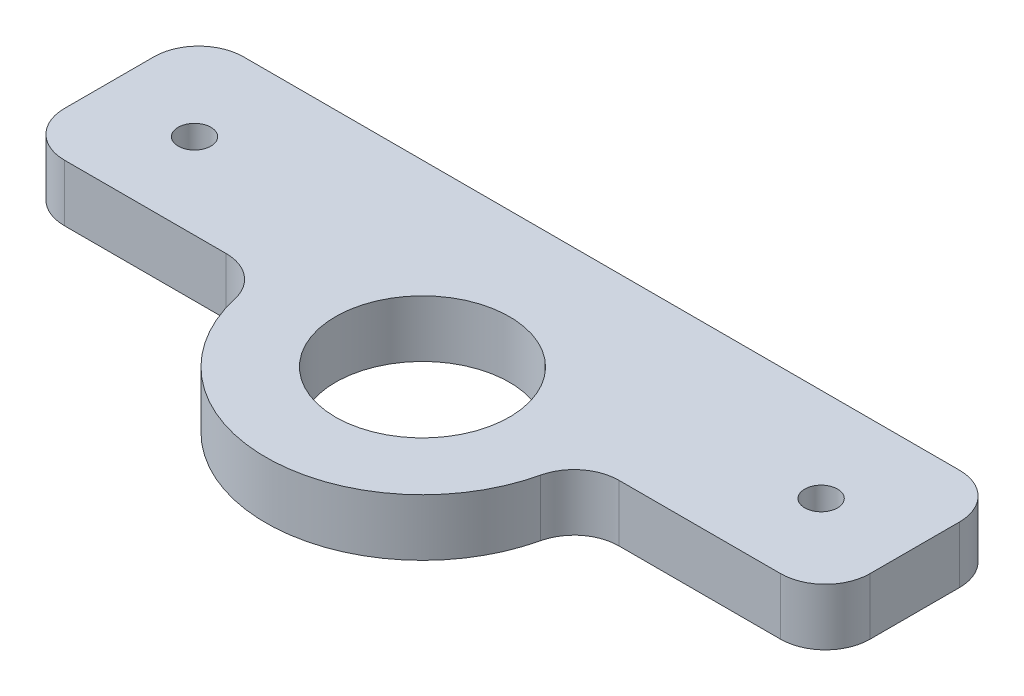
ISO-10303-21;
HEADER;
FILE_DESCRIPTION(('STEP AP214'),'2;1');
FILE_NAME('part.step','',(''),(''),'','','');
FILE_SCHEMA(('AUTOMOTIVE_DESIGN { 1 0 10303 214 1 1 1 1 }'));
ENDSEC;
DATA;
#1=APPLICATION_CONTEXT('core data for automotive mechanical design processes');
#2=APPLICATION_PROTOCOL_DEFINITION('international standard','automotive_design',2000,#1);
#3=PRODUCT_CONTEXT('',#1,'mechanical');
#4=PRODUCT('Part','Part','',(#3));
#5=PRODUCT_RELATED_PRODUCT_CATEGORY('part','',(#4));
#6=PRODUCT_DEFINITION_FORMATION('','',#4);
#7=PRODUCT_DEFINITION_CONTEXT('part definition',#1,'design');
#8=PRODUCT_DEFINITION('design','',#6,#7);
#9=PRODUCT_DEFINITION_SHAPE('','',#8);
#10=(LENGTH_UNIT() NAMED_UNIT(*) SI_UNIT(.MILLI.,.METRE.));
#11=(NAMED_UNIT(*) PLANE_ANGLE_UNIT() SI_UNIT($,.RADIAN.));
#12=(NAMED_UNIT(*) SI_UNIT($,.STERADIAN.) SOLID_ANGLE_UNIT());
#13=UNCERTAINTY_MEASURE_WITH_UNIT(LENGTH_MEASURE(1.E-05),#10,'distance_accuracy_value','');
#14=(GEOMETRIC_REPRESENTATION_CONTEXT(3) GLOBAL_UNCERTAINTY_ASSIGNED_CONTEXT((#13)) GLOBAL_UNIT_ASSIGNED_CONTEXT((#10,
#11,#12)) REPRESENTATION_CONTEXT('',''));
#15=CARTESIAN_POINT('',(0.,0.,0.));
#16=DIRECTION('',(0.,0.,1.));
#17=DIRECTION('',(1.,0.,0.));
#18=AXIS2_PLACEMENT_3D('',#15,#16,#17);
#19=CARTESIAN_POINT('',(-45.,6.35,10.));
#20=DIRECTION('',(1.,0.,0.));
#21=DIRECTION('',(0.,0.,-1.));
#22=AXIS2_PLACEMENT_3D('',#19,#20,#21);
#23=PLANE('',#22);
#24=DIRECTION('',(0.,0.,1.));
#25=VECTOR('',#24,1.);
#26=CARTESIAN_POINT('',(-45.,6.35,10.));
#27=LINE('',#26,#25);
#28=CARTESIAN_POINT('',(-45.,6.35,-5.));
#29=VERTEX_POINT('',#28);
#30=CARTESIAN_POINT('',(-45.,6.35,5.));
#31=VERTEX_POINT('',#30);
#32=EDGE_CURVE('E149',#29,#31,#27,.T.);
#33=ORIENTED_EDGE('',*,*,#32,.F.);
#34=DIRECTION('',(0.,-1.,0.));
#35=VECTOR('',#34,1.);
#36=CARTESIAN_POINT('',(-45.,6.35,-5.));
#37=LINE('',#36,#35);
#38=CARTESIAN_POINT('',(-45.,0.,-5.));
#39=VERTEX_POINT('',#38);
#40=EDGE_CURVE('E177',#29,#39,#37,.T.);
#41=ORIENTED_EDGE('',*,*,#40,.T.);
#42=DIRECTION('',(0.,0.,1.));
#43=VECTOR('',#42,1.);
#44=CARTESIAN_POINT('',(-45.,0.,10.));
#45=LINE('',#44,#43);
#46=CARTESIAN_POINT('',(-45.,0.,5.));
#47=VERTEX_POINT('',#46);
#48=EDGE_CURVE('E210',#39,#47,#45,.T.);
#49=ORIENTED_EDGE('',*,*,#48,.T.);
#50=DIRECTION('',(0.,-1.,0.));
#51=VECTOR('',#50,1.);
#52=CARTESIAN_POINT('',(-45.,6.35,5.));
#53=LINE('',#52,#51);
#54=EDGE_CURVE('E175',#47,#31,#53,.F.);
#55=ORIENTED_EDGE('',*,*,#54,.T.);
#56=EDGE_LOOP('',(#33,#41,#49,#55));
#57=FACE_BOUND('',#56,.T.);
#58=ADVANCED_FACE('F33',(#57),#23,.F.);
#59=CARTESIAN_POINT('',(-17.5,6.35,10.));
#60=DIRECTION('',(0.,0.,-1.));
#61=DIRECTION('',(-1.,0.,0.));
#62=AXIS2_PLACEMENT_3D('',#59,#60,#61);
#63=PLANE('',#62);
#64=DIRECTION('',(1.,0.,0.));
#65=VECTOR('',#64,1.);
#66=CARTESIAN_POINT('',(-17.5,6.35,10.));
#67=LINE('',#66,#65);
#68=CARTESIAN_POINT('',(-40.,6.35,10.));
#69=VERTEX_POINT('',#68);
#70=CARTESIAN_POINT('',(-21.9374109684803,6.35,10.));
#71=VERTEX_POINT('',#70);
#72=EDGE_CURVE('E153',#69,#71,#67,.T.);
#73=ORIENTED_EDGE('',*,*,#72,.F.);
#74=DIRECTION('',(0.,-1.,0.));
#75=VECTOR('',#74,1.);
#76=CARTESIAN_POINT('',(-40.,6.35,10.));
#77=LINE('',#76,#75);
#78=CARTESIAN_POINT('',(-40.,0.,10.));
#79=VERTEX_POINT('',#78);
#80=EDGE_CURVE('E182',#69,#79,#77,.T.);
#81=ORIENTED_EDGE('',*,*,#80,.T.);
#82=DIRECTION('',(1.,0.,0.));
#83=VECTOR('',#82,1.);
#84=CARTESIAN_POINT('',(-17.5,0.,10.));
#85=LINE('',#84,#83);
#86=CARTESIAN_POINT('',(-21.9374109684803,0.,10.));
#87=VERTEX_POINT('',#86);
#88=EDGE_CURVE('E199',#79,#87,#85,.T.);
#89=ORIENTED_EDGE('',*,*,#88,.T.);
#90=DIRECTION('',(0.,1.,0.));
#91=VECTOR('',#90,1.);
#92=CARTESIAN_POINT('',(-21.9374109684803,6.35,10.));
#93=LINE('',#92,#91);
#94=EDGE_CURVE('E180',#87,#71,#93,.T.);
#95=ORIENTED_EDGE('',*,*,#94,.T.);
#96=EDGE_LOOP('',(#73,#81,#89,#95));
#97=FACE_BOUND('',#96,.T.);
#98=ADVANCED_FACE('F207',(#97),#63,.F.);
#99=CARTESIAN_POINT('',(0.,6.35,10.));
#100=DIRECTION('',(0.,-1.,0.));
#101=DIRECTION('',(0.,0.,-1.));
#102=AXIS2_PLACEMENT_3D('',#99,#100,#101);
#103=CYLINDRICAL_SURFACE('',#102,17.5);
#104=CARTESIAN_POINT('',(0.,0.,10.));
#105=DIRECTION('',(0.,1.,0.));
#106=DIRECTION('',(0.,0.,1.));
#107=AXIS2_PLACEMENT_3D('',#104,#105,#106);
#108=CIRCLE('',#107,17.5);
#109=CARTESIAN_POINT('',(-17.0624307532625,0.,13.8888888888889));
#110=VERTEX_POINT('',#109);
#111=CARTESIAN_POINT('',(17.0624307532625,0.,13.8888888888889));
#112=VERTEX_POINT('',#111);
#113=EDGE_CURVE('E201',#110,#112,#108,.T.);
#114=ORIENTED_EDGE('',*,*,#113,.T.);
#115=DIRECTION('',(0.,-1.,0.));
#116=VECTOR('',#115,1.);
#117=CARTESIAN_POINT('',(17.0624307532625,6.35,13.8888888888889));
#118=LINE('',#117,#116);
#119=CARTESIAN_POINT('',(17.0624307532625,6.35,13.8888888888889));
#120=VERTEX_POINT('',#119);
#121=EDGE_CURVE('E192',#112,#120,#118,.F.);
#122=ORIENTED_EDGE('',*,*,#121,.T.);
#123=CARTESIAN_POINT('',(0.,6.35,10.));
#124=DIRECTION('',(0.,1.,0.));
#125=DIRECTION('',(0.,0.,1.));
#126=AXIS2_PLACEMENT_3D('',#123,#124,#125);
#127=CIRCLE('',#126,17.5);
#128=CARTESIAN_POINT('',(-17.0624307532625,6.35,13.8888888888889));
#129=VERTEX_POINT('',#128);
#130=EDGE_CURVE('E216',#129,#120,#127,.T.);
#131=ORIENTED_EDGE('',*,*,#130,.F.);
#132=DIRECTION('',(0.,-1.,0.));
#133=VECTOR('',#132,1.);
#134=CARTESIAN_POINT('',(-17.0624307532625,6.35,13.8888888888889));
#135=LINE('',#134,#133);
#136=EDGE_CURVE('E189',#129,#110,#135,.T.);
#137=ORIENTED_EDGE('',*,*,#136,.T.);
#138=EDGE_LOOP('',(#114,#122,#131,#137));
#139=FACE_BOUND('',#138,.T.);
#140=ADVANCED_FACE('F218',(#139),#103,.T.);
#141=CARTESIAN_POINT('',(45.,6.35,9.99999999999999));
#142=DIRECTION('',(0.,0.,-1.));
#143=DIRECTION('',(-1.,0.,0.));
#144=AXIS2_PLACEMENT_3D('',#141,#142,#143);
#145=PLANE('',#144);
#146=DIRECTION('',(1.,0.,0.));
#147=VECTOR('',#146,1.);
#148=CARTESIAN_POINT('',(45.,0.,9.99999999999999));
#149=LINE('',#148,#147);
#150=CARTESIAN_POINT('',(21.9374109684803,0.,10.));
#151=VERTEX_POINT('',#150);
#152=CARTESIAN_POINT('',(40.,0.,9.99999999999999));
#153=VERTEX_POINT('',#152);
#154=EDGE_CURVE('E155',#151,#153,#149,.T.);
#155=ORIENTED_EDGE('',*,*,#154,.T.);
#156=DIRECTION('',(0.,-1.,0.));
#157=VECTOR('',#156,1.);
#158=CARTESIAN_POINT('',(40.,6.35,9.99999999999999));
#159=LINE('',#158,#157);
#160=CARTESIAN_POINT('',(40.,6.35,9.99999999999999));
#161=VERTEX_POINT('',#160);
#162=EDGE_CURVE('E48',#153,#161,#159,.F.);
#163=ORIENTED_EDGE('',*,*,#162,.T.);
#164=DIRECTION('',(1.,0.,0.));
#165=VECTOR('',#164,1.);
#166=CARTESIAN_POINT('',(45.,6.35,9.99999999999999));
#167=LINE('',#166,#165);
#168=CARTESIAN_POINT('',(21.9374109684803,6.35,10.));
#169=VERTEX_POINT('',#168);
#170=EDGE_CURVE('E220',#169,#161,#167,.T.);
#171=ORIENTED_EDGE('',*,*,#170,.F.);
#172=DIRECTION('',(0.,1.,0.));
#173=VECTOR('',#172,1.);
#174=CARTESIAN_POINT('',(21.9374109684803,0.,10.));
#175=LINE('',#174,#173);
#176=EDGE_CURVE('E185',#169,#151,#175,.F.);
#177=ORIENTED_EDGE('',*,*,#176,.T.);
#178=EDGE_LOOP('',(#155,#163,#171,#177));
#179=FACE_BOUND('',#178,.T.);
#180=ADVANCED_FACE('F232',(#179),#145,.F.);
#181=CARTESIAN_POINT('',(45.,6.35,9.99999999999999));
#182=DIRECTION('',(-1.,0.,0.));
#183=DIRECTION('',(0.,0.,1.));
#184=AXIS2_PLACEMENT_3D('',#181,#182,#183);
#185=PLANE('',#184);
#186=DIRECTION('',(0.,0.,-1.));
#187=VECTOR('',#186,1.);
#188=CARTESIAN_POINT('',(45.,0.,9.99999999999999));
#189=LINE('',#188,#187);
#190=CARTESIAN_POINT('',(45.,0.,5.));
#191=VERTEX_POINT('',#190);
#192=CARTESIAN_POINT('',(45.,0.,-5.00000000000001));
#193=VERTEX_POINT('',#192);
#194=EDGE_CURVE('E150',#191,#193,#189,.T.);
#195=ORIENTED_EDGE('',*,*,#194,.T.);
#196=DIRECTION('',(0.,-1.,0.));
#197=VECTOR('',#196,1.);
#198=CARTESIAN_POINT('',(45.,6.35,-5.00000000000001));
#199=LINE('',#198,#197);
#200=CARTESIAN_POINT('',(45.,6.35,-5.00000000000001));
#201=VERTEX_POINT('',#200);
#202=EDGE_CURVE('E128',#193,#201,#199,.F.);
#203=ORIENTED_EDGE('',*,*,#202,.T.);
#204=DIRECTION('',(0.,0.,-1.));
#205=VECTOR('',#204,1.);
#206=CARTESIAN_POINT('',(45.,6.35,9.99999999999999));
#207=LINE('',#206,#205);
#208=CARTESIAN_POINT('',(45.,6.35,5.));
#209=VERTEX_POINT('',#208);
#210=EDGE_CURVE('E222',#209,#201,#207,.T.);
#211=ORIENTED_EDGE('',*,*,#210,.F.);
#212=DIRECTION('',(0.,-1.,0.));
#213=VECTOR('',#212,1.);
#214=CARTESIAN_POINT('',(45.,6.35,5.));
#215=LINE('',#214,#213);
#216=EDGE_CURVE('E133',#209,#191,#215,.T.);
#217=ORIENTED_EDGE('',*,*,#216,.T.);
#218=EDGE_LOOP('',(#195,#203,#211,#217));
#219=FACE_BOUND('',#218,.T.);
#220=ADVANCED_FACE('F240',(#219),#185,.F.);
#221=CARTESIAN_POINT('',(45.,6.35,-10.));
#222=DIRECTION('',(0.,0.,1.));
#223=DIRECTION('',(1.,0.,0.));
#224=AXIS2_PLACEMENT_3D('',#221,#222,#223);
#225=PLANE('',#224);
#226=DIRECTION('',(-1.,0.,0.));
#227=VECTOR('',#226,1.);
#228=CARTESIAN_POINT('',(45.,6.35,-10.));
#229=LINE('',#228,#227);
#230=CARTESIAN_POINT('',(40.,6.35,-10.));
#231=VERTEX_POINT('',#230);
#232=CARTESIAN_POINT('',(-40.,6.35,-9.99999999999999));
#233=VERTEX_POINT('',#232);
#234=EDGE_CURVE('E143',#231,#233,#229,.T.);
#235=ORIENTED_EDGE('',*,*,#234,.F.);
#236=DIRECTION('',(0.,-1.,0.));
#237=VECTOR('',#236,1.);
#238=CARTESIAN_POINT('',(40.,6.35,-10.));
#239=LINE('',#238,#237);
#240=CARTESIAN_POINT('',(40.,0.,-10.));
#241=VERTEX_POINT('',#240);
#242=EDGE_CURVE('E127',#231,#241,#239,.T.);
#243=ORIENTED_EDGE('',*,*,#242,.T.);
#244=DIRECTION('',(-1.,0.,0.));
#245=VECTOR('',#244,1.);
#246=CARTESIAN_POINT('',(45.,0.,-10.));
#247=LINE('',#246,#245);
#248=CARTESIAN_POINT('',(-40.,0.,-9.99999999999999));
#249=VERTEX_POINT('',#248);
#250=EDGE_CURVE('E140',#241,#249,#247,.T.);
#251=ORIENTED_EDGE('',*,*,#250,.T.);
#252=DIRECTION('',(0.,-1.,0.));
#253=VECTOR('',#252,1.);
#254=CARTESIAN_POINT('',(-40.,6.35,-9.99999999999999));
#255=LINE('',#254,#253);
#256=EDGE_CURVE('E145',#249,#233,#255,.F.);
#257=ORIENTED_EDGE('',*,*,#256,.T.);
#258=EDGE_LOOP('',(#235,#243,#251,#257));
#259=FACE_BOUND('',#258,.T.);
#260=ADVANCED_FACE('F139',(#259),#225,.F.);
#261=CARTESIAN_POINT('',(0.,6.35,10.));
#262=DIRECTION('',(0.,1.,0.));
#263=DIRECTION('',(0.,0.,1.));
#264=AXIS2_PLACEMENT_3D('',#261,#262,#263);
#265=PLANE('',#264);
#266=CARTESIAN_POINT('',(-35.,6.35,0.464999999999995));
#267=DIRECTION('',(0.,1.,0.));
#268=DIRECTION('',(0.,0.,1.));
#269=AXIS2_PLACEMENT_3D('',#266,#267,#268);
#270=CIRCLE('',#269,1.8288);
#271=CARTESIAN_POINT('',(-35.,6.35,2.29379999999999));
#272=VERTEX_POINT('',#271);
#273=EDGE_CURVE('E321',#272,#272,#270,.T.);
#274=ORIENTED_EDGE('',*,*,#273,.F.);
#275=EDGE_LOOP('',(#274));
#276=FACE_BOUND('',#275,.T.);
#277=CARTESIAN_POINT('',(35.,6.35,0.464999999999995));
#278=DIRECTION('',(0.,1.,0.));
#279=DIRECTION('',(0.,0.,1.));
#280=AXIS2_PLACEMENT_3D('',#277,#278,#279);
#281=CIRCLE('',#280,1.8288);
#282=CARTESIAN_POINT('',(35.,6.35,2.29379999999999));
#283=VERTEX_POINT('',#282);
#284=EDGE_CURVE('E317',#283,#283,#281,.T.);
#285=ORIENTED_EDGE('',*,*,#284,.F.);
#286=EDGE_LOOP('',(#285));
#287=FACE_BOUND('',#286,.T.);
#288=CARTESIAN_POINT('',(0.,6.35,10.));
#289=DIRECTION('',(0.,1.,0.));
#290=DIRECTION('',(0.,0.,1.));
#291=AXIS2_PLACEMENT_3D('',#288,#289,#290);
#292=CIRCLE('',#291,9.72311999999999);
#293=CARTESIAN_POINT('',(0.,6.35,19.72312));
#294=VERTEX_POINT('',#293);
#295=EDGE_CURVE('E311',#294,#294,#292,.T.);
#296=ORIENTED_EDGE('',*,*,#295,.F.);
#297=EDGE_LOOP('',(#296));
#298=FACE_BOUND('',#297,.T.);
#299=ORIENTED_EDGE('',*,*,#210,.T.);
#300=CARTESIAN_POINT('',(40.,6.35,-5.00000000000001));
#301=DIRECTION('',(0.,1.,0.));
#302=DIRECTION('',(0.,0.,1.));
#303=AXIS2_PLACEMENT_3D('',#300,#301,#302);
#304=CIRCLE('',#303,5.);
#305=EDGE_CURVE('E173',#201,#231,#304,.T.);
#306=ORIENTED_EDGE('',*,*,#305,.T.);
#307=ORIENTED_EDGE('',*,*,#234,.T.);
#308=CARTESIAN_POINT('',(-40.,6.35,-5.));
#309=DIRECTION('',(0.,1.,0.));
#310=DIRECTION('',(0.,0.,1.));
#311=AXIS2_PLACEMENT_3D('',#308,#309,#310);
#312=CIRCLE('',#311,5.);
#313=EDGE_CURVE('E171',#233,#29,#312,.T.);
#314=ORIENTED_EDGE('',*,*,#313,.T.);
#315=ORIENTED_EDGE('',*,*,#32,.T.);
#316=CARTESIAN_POINT('',(-40.,6.35,5.));
#317=DIRECTION('',(0.,1.,0.));
#318=DIRECTION('',(0.,0.,1.));
#319=AXIS2_PLACEMENT_3D('',#316,#317,#318);
#320=CIRCLE('',#319,5.);
#321=EDGE_CURVE('E169',#31,#69,#320,.T.);
#322=ORIENTED_EDGE('',*,*,#321,.T.);
#323=ORIENTED_EDGE('',*,*,#72,.T.);
#324=CARTESIAN_POINT('',(-21.9374109684803,6.35,15.));
#325=DIRECTION('',(0.,1.,0.));
#326=DIRECTION('',(0.,0.,1.));
#327=AXIS2_PLACEMENT_3D('',#324,#325,#326);
#328=CIRCLE('',#327,5.);
#329=EDGE_CURVE('E11',#71,#129,#328,.F.);
#330=ORIENTED_EDGE('',*,*,#329,.T.);
#331=ORIENTED_EDGE('',*,*,#130,.T.);
#332=CARTESIAN_POINT('',(21.9374109684803,6.35,15.));
#333=DIRECTION('',(0.,1.,0.));
#334=DIRECTION('',(0.,0.,1.));
#335=AXIS2_PLACEMENT_3D('',#332,#333,#334);
#336=CIRCLE('',#335,5.);
#337=EDGE_CURVE('E55',#120,#169,#336,.F.);
#338=ORIENTED_EDGE('',*,*,#337,.T.);
#339=ORIENTED_EDGE('',*,*,#170,.T.);
#340=CARTESIAN_POINT('',(40.,6.35,5.));
#341=DIRECTION('',(0.,1.,0.));
#342=DIRECTION('',(0.,0.,1.));
#343=AXIS2_PLACEMENT_3D('',#340,#341,#342);
#344=CIRCLE('',#343,5.);
#345=EDGE_CURVE('E167',#161,#209,#344,.T.);
#346=ORIENTED_EDGE('',*,*,#345,.T.);
#347=EDGE_LOOP('',(#299,#306,#307,#314,#315,#322,#323,#330,#331,#338,#339,#346));
#348=FACE_BOUND('',#347,.T.);
#349=ADVANCED_FACE('F215',(#276,#287,#298,#348),#265,.T.);
#350=CARTESIAN_POINT('',(0.,0.,10.));
#351=DIRECTION('',(0.,1.,0.));
#352=DIRECTION('',(0.,0.,1.));
#353=AXIS2_PLACEMENT_3D('',#350,#351,#352);
#354=PLANE('',#353);
#355=CARTESIAN_POINT('',(-35.,0.,0.464999999999995));
#356=DIRECTION('',(0.,1.,0.));
#357=DIRECTION('',(0.,0.,1.));
#358=AXIS2_PLACEMENT_3D('',#355,#356,#357);
#359=CIRCLE('',#358,1.8288);
#360=CARTESIAN_POINT('',(-35.,0.,2.29379999999999));
#361=VERTEX_POINT('',#360);
#362=EDGE_CURVE('E305',#361,#361,#359,.T.);
#363=ORIENTED_EDGE('',*,*,#362,.T.);
#364=EDGE_LOOP('',(#363));
#365=FACE_BOUND('',#364,.T.);
#366=CARTESIAN_POINT('',(35.,0.,0.464999999999995));
#367=DIRECTION('',(0.,1.,0.));
#368=DIRECTION('',(0.,0.,1.));
#369=AXIS2_PLACEMENT_3D('',#366,#367,#368);
#370=CIRCLE('',#369,1.8288);
#371=CARTESIAN_POINT('',(35.,0.,2.29379999999999));
#372=VERTEX_POINT('',#371);
#373=EDGE_CURVE('E308',#372,#372,#370,.T.);
#374=ORIENTED_EDGE('',*,*,#373,.T.);
#375=EDGE_LOOP('',(#374));
#376=FACE_BOUND('',#375,.T.);
#377=CARTESIAN_POINT('',(0.,0.,10.));
#378=DIRECTION('',(0.,1.,0.));
#379=DIRECTION('',(0.,0.,1.));
#380=AXIS2_PLACEMENT_3D('',#377,#378,#379);
#381=CIRCLE('',#380,9.72311999999999);
#382=CARTESIAN_POINT('',(0.,0.,19.72312));
#383=VERTEX_POINT('',#382);
#384=EDGE_CURVE('E229',#383,#383,#381,.T.);
#385=ORIENTED_EDGE('',*,*,#384,.T.);
#386=EDGE_LOOP('',(#385));
#387=FACE_BOUND('',#386,.T.);
#388=ORIENTED_EDGE('',*,*,#250,.F.);
#389=CARTESIAN_POINT('',(40.,0.,-5.00000000000001));
#390=DIRECTION('',(0.,1.,0.));
#391=DIRECTION('',(0.,0.,1.));
#392=AXIS2_PLACEMENT_3D('',#389,#390,#391);
#393=CIRCLE('',#392,5.);
#394=EDGE_CURVE('E123',#241,#193,#393,.F.);
#395=ORIENTED_EDGE('',*,*,#394,.T.);
#396=ORIENTED_EDGE('',*,*,#194,.F.);
#397=CARTESIAN_POINT('',(40.,0.,5.));
#398=DIRECTION('',(0.,1.,0.));
#399=DIRECTION('',(0.,0.,1.));
#400=AXIS2_PLACEMENT_3D('',#397,#398,#399);
#401=CIRCLE('',#400,5.);
#402=EDGE_CURVE('E144',#191,#153,#401,.F.);
#403=ORIENTED_EDGE('',*,*,#402,.T.);
#404=ORIENTED_EDGE('',*,*,#154,.F.);
#405=CARTESIAN_POINT('',(21.9374109684803,0.,15.));
#406=DIRECTION('',(0.,1.,0.));
#407=DIRECTION('',(0.,0.,1.));
#408=AXIS2_PLACEMENT_3D('',#405,#406,#407);
#409=CIRCLE('',#408,5.);
#410=EDGE_CURVE('E194',#151,#112,#409,.T.);
#411=ORIENTED_EDGE('',*,*,#410,.T.);
#412=ORIENTED_EDGE('',*,*,#113,.F.);
#413=CARTESIAN_POINT('',(-21.9374109684803,0.,15.));
#414=DIRECTION('',(0.,1.,0.));
#415=DIRECTION('',(0.,0.,1.));
#416=AXIS2_PLACEMENT_3D('',#413,#414,#415);
#417=CIRCLE('',#416,5.);
#418=EDGE_CURVE('E41',#110,#87,#417,.T.);
#419=ORIENTED_EDGE('',*,*,#418,.T.);
#420=ORIENTED_EDGE('',*,*,#88,.F.);
#421=CARTESIAN_POINT('',(-40.,0.,5.));
#422=DIRECTION('',(0.,1.,0.));
#423=DIRECTION('',(0.,0.,1.));
#424=AXIS2_PLACEMENT_3D('',#421,#422,#423);
#425=CIRCLE('',#424,5.);
#426=EDGE_CURVE('E161',#79,#47,#425,.F.);
#427=ORIENTED_EDGE('',*,*,#426,.T.);
#428=ORIENTED_EDGE('',*,*,#48,.F.);
#429=CARTESIAN_POINT('',(-40.,0.,-5.));
#430=DIRECTION('',(0.,1.,0.));
#431=DIRECTION('',(0.,0.,1.));
#432=AXIS2_PLACEMENT_3D('',#429,#430,#431);
#433=CIRCLE('',#432,5.);
#434=EDGE_CURVE('E134',#39,#249,#433,.F.);
#435=ORIENTED_EDGE('',*,*,#434,.T.);
#436=EDGE_LOOP('',(#388,#395,#396,#403,#404,#411,#412,#419,#420,#427,#428,#435));
#437=FACE_BOUND('',#436,.T.);
#438=ADVANCED_FACE('F147',(#365,#376,#387,#437),#354,.F.);
#439=CARTESIAN_POINT('',(0.,6.35,10.));
#440=DIRECTION('',(0.,1.,0.));
#441=DIRECTION('',(0.,0.,1.));
#442=AXIS2_PLACEMENT_3D('',#439,#440,#441);
#443=CYLINDRICAL_SURFACE('',#442,9.72311999999999);
#444=ORIENTED_EDGE('',*,*,#384,.F.);
#445=EDGE_LOOP('',(#444));
#446=FACE_BOUND('',#445,.T.);
#447=ORIENTED_EDGE('',*,*,#295,.T.);
#448=EDGE_LOOP('',(#447));
#449=FACE_BOUND('',#448,.T.);
#450=ADVANCED_FACE('F262',(#446,#449),#443,.F.);
#451=CARTESIAN_POINT('',(40.,6.35,-5.00000000000001));
#452=DIRECTION('',(0.,-1.,0.));
#453=DIRECTION('',(0.,0.,-1.));
#454=AXIS2_PLACEMENT_3D('',#451,#452,#453);
#455=CYLINDRICAL_SURFACE('',#454,5.);
#456=ORIENTED_EDGE('',*,*,#305,.F.);
#457=ORIENTED_EDGE('',*,*,#202,.F.);
#458=ORIENTED_EDGE('',*,*,#394,.F.);
#459=ORIENTED_EDGE('',*,*,#242,.F.);
#460=EDGE_LOOP('',(#456,#457,#458,#459));
#461=FACE_BOUND('',#460,.T.);
#462=ADVANCED_FACE('F126',(#461),#455,.T.);
#463=CARTESIAN_POINT('',(-40.,6.35,-5.));
#464=DIRECTION('',(0.,-1.,0.));
#465=DIRECTION('',(0.,0.,-1.));
#466=AXIS2_PLACEMENT_3D('',#463,#464,#465);
#467=CYLINDRICAL_SURFACE('',#466,5.);
#468=ORIENTED_EDGE('',*,*,#313,.F.);
#469=ORIENTED_EDGE('',*,*,#256,.F.);
#470=ORIENTED_EDGE('',*,*,#434,.F.);
#471=ORIENTED_EDGE('',*,*,#40,.F.);
#472=EDGE_LOOP('',(#468,#469,#470,#471));
#473=FACE_BOUND('',#472,.T.);
#474=ADVANCED_FACE('F261',(#473),#467,.T.);
#475=CARTESIAN_POINT('',(-40.,6.35,5.));
#476=DIRECTION('',(0.,-1.,0.));
#477=DIRECTION('',(0.,0.,-1.));
#478=AXIS2_PLACEMENT_3D('',#475,#476,#477);
#479=CYLINDRICAL_SURFACE('',#478,5.);
#480=ORIENTED_EDGE('',*,*,#321,.F.);
#481=ORIENTED_EDGE('',*,*,#54,.F.);
#482=ORIENTED_EDGE('',*,*,#426,.F.);
#483=ORIENTED_EDGE('',*,*,#80,.F.);
#484=EDGE_LOOP('',(#480,#481,#482,#483));
#485=FACE_BOUND('',#484,.T.);
#486=ADVANCED_FACE('F265',(#485),#479,.T.);
#487=CARTESIAN_POINT('',(40.,6.35,5.));
#488=DIRECTION('',(0.,-1.,0.));
#489=DIRECTION('',(0.,0.,-1.));
#490=AXIS2_PLACEMENT_3D('',#487,#488,#489);
#491=CYLINDRICAL_SURFACE('',#490,5.);
#492=ORIENTED_EDGE('',*,*,#345,.F.);
#493=ORIENTED_EDGE('',*,*,#162,.F.);
#494=ORIENTED_EDGE('',*,*,#402,.F.);
#495=ORIENTED_EDGE('',*,*,#216,.F.);
#496=EDGE_LOOP('',(#492,#493,#494,#495));
#497=FACE_BOUND('',#496,.T.);
#498=ADVANCED_FACE('F236',(#497),#491,.T.);
#499=CARTESIAN_POINT('',(21.9374109684803,6.35,15.));
#500=DIRECTION('',(0.,-1.,0.));
#501=DIRECTION('',(0.,0.,-1.));
#502=AXIS2_PLACEMENT_3D('',#499,#500,#501);
#503=CYLINDRICAL_SURFACE('',#502,5.);
#504=ORIENTED_EDGE('',*,*,#337,.F.);
#505=ORIENTED_EDGE('',*,*,#121,.F.);
#506=ORIENTED_EDGE('',*,*,#410,.F.);
#507=ORIENTED_EDGE('',*,*,#176,.F.);
#508=EDGE_LOOP('',(#504,#505,#506,#507));
#509=FACE_BOUND('',#508,.T.);
#510=ADVANCED_FACE('F271',(#509),#503,.F.);
#511=CARTESIAN_POINT('',(-21.9374109684803,6.35,15.));
#512=DIRECTION('',(0.,-1.,0.));
#513=DIRECTION('',(0.,0.,-1.));
#514=AXIS2_PLACEMENT_3D('',#511,#512,#513);
#515=CYLINDRICAL_SURFACE('',#514,5.);
#516=ORIENTED_EDGE('',*,*,#329,.F.);
#517=ORIENTED_EDGE('',*,*,#94,.F.);
#518=ORIENTED_EDGE('',*,*,#418,.F.);
#519=ORIENTED_EDGE('',*,*,#136,.F.);
#520=EDGE_LOOP('',(#516,#517,#518,#519));
#521=FACE_BOUND('',#520,.T.);
#522=ADVANCED_FACE('F35',(#521),#515,.F.);
#523=CARTESIAN_POINT('',(35.,6.35,0.464999999999995));
#524=DIRECTION('',(0.,1.,0.));
#525=DIRECTION('',(0.,0.,1.));
#526=AXIS2_PLACEMENT_3D('',#523,#524,#525);
#527=CYLINDRICAL_SURFACE('',#526,1.8288);
#528=ORIENTED_EDGE('',*,*,#373,.F.);
#529=EDGE_LOOP('',(#528));
#530=FACE_BOUND('',#529,.T.);
#531=ORIENTED_EDGE('',*,*,#284,.T.);
#532=EDGE_LOOP('',(#531));
#533=FACE_BOUND('',#532,.T.);
#534=ADVANCED_FACE('F277',(#530,#533),#527,.F.);
#535=CARTESIAN_POINT('',(-35.,6.35,0.464999999999995));
#536=DIRECTION('',(0.,1.,0.));
#537=DIRECTION('',(0.,0.,1.));
#538=AXIS2_PLACEMENT_3D('',#535,#536,#537);
#539=CYLINDRICAL_SURFACE('',#538,1.8288);
#540=ORIENTED_EDGE('',*,*,#362,.F.);
#541=EDGE_LOOP('',(#540));
#542=FACE_BOUND('',#541,.T.);
#543=ORIENTED_EDGE('',*,*,#273,.T.);
#544=EDGE_LOOP('',(#543));
#545=FACE_BOUND('',#544,.T.);
#546=ADVANCED_FACE('F281',(#542,#545),#539,.F.);
#547=CLOSED_SHELL('',(#58,#98,#140,#180,#220,#260,#349,#438,#450,#462,#474,#486,#498,#510,#522,
#534,#546));
#548=MANIFOLD_SOLID_BREP('B2',#547);
#549=ADVANCED_BREP_SHAPE_REPRESENTATION('',(#18,#548),#14);
#550=SHAPE_DEFINITION_REPRESENTATION(#9,#549);
ENDSEC;
END-ISO-10303-21;
